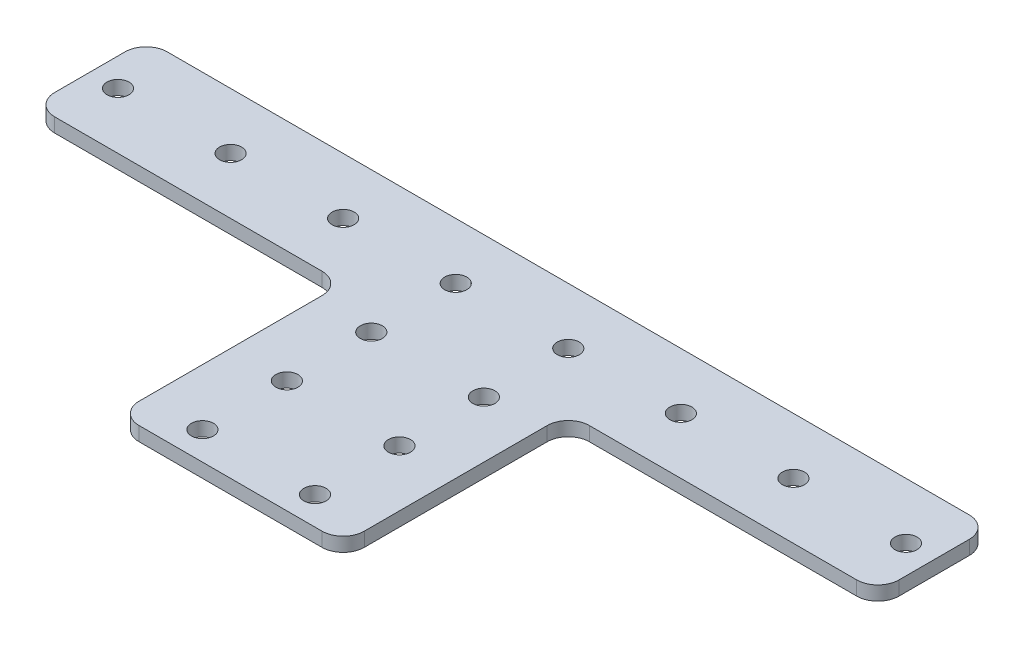
ISO-10303-21;
HEADER;
FILE_DESCRIPTION(('STEP AP214'),'2;1');
FILE_NAME('part.step','',(''),(''),'','','');
FILE_SCHEMA(('AUTOMOTIVE_DESIGN { 1 0 10303 214 1 1 1 1 }'));
ENDSEC;
DATA;
#1=APPLICATION_CONTEXT('core data for automotive mechanical design processes');
#2=APPLICATION_PROTOCOL_DEFINITION('international standard','automotive_design',2000,#1);
#3=PRODUCT_CONTEXT('',#1,'mechanical');
#4=PRODUCT('Part','Part','',(#3));
#5=PRODUCT_RELATED_PRODUCT_CATEGORY('part','',(#4));
#6=PRODUCT_DEFINITION_FORMATION('','',#4);
#7=PRODUCT_DEFINITION_CONTEXT('part definition',#1,'design');
#8=PRODUCT_DEFINITION('design','',#6,#7);
#9=PRODUCT_DEFINITION_SHAPE('','',#8);
#10=(LENGTH_UNIT() NAMED_UNIT(*) SI_UNIT(.MILLI.,.METRE.));
#11=(NAMED_UNIT(*) PLANE_ANGLE_UNIT() SI_UNIT($,.RADIAN.));
#12=(NAMED_UNIT(*) SI_UNIT($,.STERADIAN.) SOLID_ANGLE_UNIT());
#13=UNCERTAINTY_MEASURE_WITH_UNIT(LENGTH_MEASURE(1.E-05),#10,'distance_accuracy_value','');
#14=(GEOMETRIC_REPRESENTATION_CONTEXT(3) GLOBAL_UNCERTAINTY_ASSIGNED_CONTEXT((#13)) GLOBAL_UNIT_ASSIGNED_CONTEXT((#10,
#11,#12)) REPRESENTATION_CONTEXT('',''));
#15=CARTESIAN_POINT('',(0.,0.,0.));
#16=DIRECTION('',(0.,0.,1.));
#17=DIRECTION('',(1.,0.,0.));
#18=AXIS2_PLACEMENT_3D('',#15,#16,#17);
#19=CARTESIAN_POINT('',(120.65,3.175,0.));
#20=DIRECTION('',(1.,0.,0.));
#21=DIRECTION('',(0.,0.,-1.));
#22=AXIS2_PLACEMENT_3D('',#19,#20,#21);
#23=PLANE('',#22);
#24=DIRECTION('',(0.,0.,1.));
#25=VECTOR('',#24,1.);
#26=CARTESIAN_POINT('',(120.65,0.,0.));
#27=LINE('',#26,#25);
#28=CARTESIAN_POINT('',(120.65,0.,4.7625));
#29=VERTEX_POINT('',#28);
#30=CARTESIAN_POINT('',(120.65,0.,46.0375));
#31=VERTEX_POINT('',#30);
#32=EDGE_CURVE('E185',#29,#31,#27,.T.);
#33=ORIENTED_EDGE('',*,*,#32,.F.);
#34=DIRECTION('',(0.,-1.,0.));
#35=VECTOR('',#34,1.);
#36=CARTESIAN_POINT('',(120.65,3.175,4.7625));
#37=LINE('',#36,#35);
#38=CARTESIAN_POINT('',(120.65,3.175,4.7625));
#39=VERTEX_POINT('',#38);
#40=EDGE_CURVE('E259',#29,#39,#37,.F.);
#41=ORIENTED_EDGE('',*,*,#40,.T.);
#42=DIRECTION('',(0.,0.,1.));
#43=VECTOR('',#42,1.);
#44=CARTESIAN_POINT('',(120.65,3.175,0.));
#45=LINE('',#44,#43);
#46=CARTESIAN_POINT('',(120.65,3.175,46.0375));
#47=VERTEX_POINT('',#46);
#48=EDGE_CURVE('E362',#39,#47,#45,.T.);
#49=ORIENTED_EDGE('',*,*,#48,.T.);
#50=DIRECTION('',(0.,-1.,0.));
#51=VECTOR('',#50,1.);
#52=CARTESIAN_POINT('',(120.65,0.,46.0375));
#53=LINE('',#52,#51);
#54=EDGE_CURVE('E256',#47,#31,#53,.T.);
#55=ORIENTED_EDGE('',*,*,#54,.T.);
#56=EDGE_LOOP('',(#33,#41,#49,#55));
#57=FACE_BOUND('',#56,.T.);
#58=ADVANCED_FACE('F39',(#57),#23,.T.);
#59=CARTESIAN_POINT('',(0.,3.175,0.));
#60=DIRECTION('',(0.,0.,-1.));
#61=DIRECTION('',(-1.,0.,0.));
#62=AXIS2_PLACEMENT_3D('',#59,#60,#61);
#63=PLANE('',#62);
#64=DIRECTION('',(1.,0.,0.));
#65=VECTOR('',#64,1.);
#66=CARTESIAN_POINT('',(0.,0.,0.));
#67=LINE('',#66,#65);
#68=CARTESIAN_POINT('',(125.4125,0.,0.));
#69=VERTEX_POINT('',#68);
#70=CARTESIAN_POINT('',(185.7375,0.,0.));
#71=VERTEX_POINT('',#70);
#72=EDGE_CURVE('E181',#69,#71,#67,.T.);
#73=ORIENTED_EDGE('',*,*,#72,.T.);
#74=DIRECTION('',(0.,-1.,0.));
#75=VECTOR('',#74,1.);
#76=CARTESIAN_POINT('',(185.7375,3.175,0.));
#77=LINE('',#76,#75);
#78=CARTESIAN_POINT('',(185.7375,3.175,0.));
#79=VERTEX_POINT('',#78);
#80=EDGE_CURVE('E158',#71,#79,#77,.F.);
#81=ORIENTED_EDGE('',*,*,#80,.T.);
#82=DIRECTION('',(1.,0.,0.));
#83=VECTOR('',#82,1.);
#84=CARTESIAN_POINT('',(0.,3.175,0.));
#85=LINE('',#84,#83);
#86=CARTESIAN_POINT('',(125.4125,3.175,0.));
#87=VERTEX_POINT('',#86);
#88=EDGE_CURVE('E306',#87,#79,#85,.T.);
#89=ORIENTED_EDGE('',*,*,#88,.F.);
#90=DIRECTION('',(0.,-1.,0.));
#91=VECTOR('',#90,1.);
#92=CARTESIAN_POINT('',(125.4125,3.175,0.));
#93=LINE('',#92,#91);
#94=EDGE_CURVE('E163',#87,#69,#93,.T.);
#95=ORIENTED_EDGE('',*,*,#94,.T.);
#96=EDGE_LOOP('',(#73,#81,#89,#95));
#97=FACE_BOUND('',#96,.T.);
#98=ADVANCED_FACE('F364',(#97),#63,.F.);
#99=CARTESIAN_POINT('',(190.5,3.175,0.));
#100=DIRECTION('',(-1.,0.,0.));
#101=DIRECTION('',(0.,0.,1.));
#102=AXIS2_PLACEMENT_3D('',#99,#100,#101);
#103=PLANE('',#102);
#104=DIRECTION('',(0.,0.,-1.));
#105=VECTOR('',#104,1.);
#106=CARTESIAN_POINT('',(190.5,3.175,0.));
#107=LINE('',#106,#105);
#108=CARTESIAN_POINT('',(190.5,3.175,-4.7625));
#109=VERTEX_POINT('',#108);
#110=CARTESIAN_POINT('',(190.5,3.175,-20.6375));
#111=VERTEX_POINT('',#110);
#112=EDGE_CURVE('E173',#109,#111,#107,.T.);
#113=ORIENTED_EDGE('',*,*,#112,.F.);
#114=DIRECTION('',(0.,-1.,0.));
#115=VECTOR('',#114,1.);
#116=CARTESIAN_POINT('',(190.5,3.175,-4.7625));
#117=LINE('',#116,#115);
#118=CARTESIAN_POINT('',(190.5,0.,-4.7625));
#119=VERTEX_POINT('',#118);
#120=EDGE_CURVE('E157',#109,#119,#117,.T.);
#121=ORIENTED_EDGE('',*,*,#120,.T.);
#122=DIRECTION('',(0.,0.,-1.));
#123=VECTOR('',#122,1.);
#124=CARTESIAN_POINT('',(190.5,0.,0.));
#125=LINE('',#124,#123);
#126=CARTESIAN_POINT('',(190.5,0.,-20.6375));
#127=VERTEX_POINT('',#126);
#128=EDGE_CURVE('E170',#119,#127,#125,.T.);
#129=ORIENTED_EDGE('',*,*,#128,.T.);
#130=DIRECTION('',(0.,-1.,0.));
#131=VECTOR('',#130,1.);
#132=CARTESIAN_POINT('',(190.5,3.175,-20.6375));
#133=LINE('',#132,#131);
#134=EDGE_CURVE('E175',#127,#111,#133,.F.);
#135=ORIENTED_EDGE('',*,*,#134,.T.);
#136=EDGE_LOOP('',(#113,#121,#129,#135));
#137=FACE_BOUND('',#136,.T.);
#138=ADVANCED_FACE('F169',(#137),#103,.F.);
#139=CARTESIAN_POINT('',(0.,3.175,-25.4));
#140=DIRECTION('',(0.,0.,-1.));
#141=DIRECTION('',(-1.,0.,0.));
#142=AXIS2_PLACEMENT_3D('',#139,#140,#141);
#143=PLANE('',#142);
#144=DIRECTION('',(1.,0.,0.));
#145=VECTOR('',#144,1.);
#146=CARTESIAN_POINT('',(0.,0.,-25.4));
#147=LINE('',#146,#145);
#148=CARTESIAN_POINT('',(4.7625,0.,-25.4));
#149=VERTEX_POINT('',#148);
#150=CARTESIAN_POINT('',(185.7375,0.,-25.4));
#151=VERTEX_POINT('',#150);
#152=EDGE_CURVE('E180',#149,#151,#147,.T.);
#153=ORIENTED_EDGE('',*,*,#152,.F.);
#154=DIRECTION('',(0.,-1.,0.));
#155=VECTOR('',#154,1.);
#156=CARTESIAN_POINT('',(4.7625,3.175,-25.4));
#157=LINE('',#156,#155);
#158=CARTESIAN_POINT('',(4.7625,3.175,-25.4));
#159=VERTEX_POINT('',#158);
#160=EDGE_CURVE('E273',#149,#159,#157,.F.);
#161=ORIENTED_EDGE('',*,*,#160,.T.);
#162=DIRECTION('',(1.,0.,0.));
#163=VECTOR('',#162,1.);
#164=CARTESIAN_POINT('',(0.,3.175,-25.4));
#165=LINE('',#164,#163);
#166=CARTESIAN_POINT('',(185.7375,3.175,-25.4));
#167=VERTEX_POINT('',#166);
#168=EDGE_CURVE('E365',#159,#167,#165,.T.);
#169=ORIENTED_EDGE('',*,*,#168,.T.);
#170=DIRECTION('',(0.,-1.,0.));
#171=VECTOR('',#170,1.);
#172=CARTESIAN_POINT('',(185.7375,0.,-25.4));
#173=LINE('',#172,#171);
#174=EDGE_CURVE('E270',#167,#151,#173,.T.);
#175=ORIENTED_EDGE('',*,*,#174,.T.);
#176=EDGE_LOOP('',(#153,#161,#169,#175));
#177=FACE_BOUND('',#176,.T.);
#178=ADVANCED_FACE('F387',(#177),#143,.T.);
#179=CARTESIAN_POINT('',(0.,3.175,0.));
#180=DIRECTION('',(-1.,0.,0.));
#181=DIRECTION('',(0.,0.,1.));
#182=AXIS2_PLACEMENT_3D('',#179,#180,#181);
#183=PLANE('',#182);
#184=DIRECTION('',(0.,0.,-1.));
#185=VECTOR('',#184,1.);
#186=CARTESIAN_POINT('',(0.,0.,0.));
#187=LINE('',#186,#185);
#188=CARTESIAN_POINT('',(0.,0.,-4.7625));
#189=VERTEX_POINT('',#188);
#190=CARTESIAN_POINT('',(0.,0.,-20.6375));
#191=VERTEX_POINT('',#190);
#192=EDGE_CURVE('E183',#189,#191,#187,.T.);
#193=ORIENTED_EDGE('',*,*,#192,.F.);
#194=DIRECTION('',(0.,-1.,0.));
#195=VECTOR('',#194,1.);
#196=CARTESIAN_POINT('',(0.,3.175,-4.7625));
#197=LINE('',#196,#195);
#198=CARTESIAN_POINT('',(0.,3.175,-4.7625));
#199=VERTEX_POINT('',#198);
#200=EDGE_CURVE('E254',#189,#199,#197,.F.);
#201=ORIENTED_EDGE('',*,*,#200,.T.);
#202=DIRECTION('',(0.,0.,-1.));
#203=VECTOR('',#202,1.);
#204=CARTESIAN_POINT('',(0.,3.175,0.));
#205=LINE('',#204,#203);
#206=CARTESIAN_POINT('',(0.,3.175,-20.6375));
#207=VERTEX_POINT('',#206);
#208=EDGE_CURVE('E304',#199,#207,#205,.T.);
#209=ORIENTED_EDGE('',*,*,#208,.T.);
#210=DIRECTION('',(0.,-1.,0.));
#211=VECTOR('',#210,1.);
#212=CARTESIAN_POINT('',(0.,3.175,-20.6375));
#213=LINE('',#212,#211);
#214=EDGE_CURVE('E251',#207,#191,#213,.T.);
#215=ORIENTED_EDGE('',*,*,#214,.T.);
#216=EDGE_LOOP('',(#193,#201,#209,#215));
#217=FACE_BOUND('',#216,.T.);
#218=ADVANCED_FACE('F379',(#217),#183,.T.);
#219=CARTESIAN_POINT('',(4.7625,3.175,0.));
#220=VERTEX_POINT('',#219);
#221=CARTESIAN_POINT('',(65.0875,3.175,0.));
#222=VERTEX_POINT('',#221);
#223=EDGE_CURVE('E296',#220,#222,#85,.T.);
#224=ORIENTED_EDGE('',*,*,#223,.F.);
#225=DIRECTION('',(0.,-1.,0.));
#226=VECTOR('',#225,1.);
#227=CARTESIAN_POINT('',(4.7625,0.,0.));
#228=LINE('',#227,#226);
#229=CARTESIAN_POINT('',(4.7625,0.,0.));
#230=VERTEX_POINT('',#229);
#231=EDGE_CURVE('E248',#220,#230,#228,.T.);
#232=ORIENTED_EDGE('',*,*,#231,.T.);
#233=CARTESIAN_POINT('',(65.0875,0.,0.));
#234=VERTEX_POINT('',#233);
#235=EDGE_CURVE('E187',#230,#234,#67,.T.);
#236=ORIENTED_EDGE('',*,*,#235,.T.);
#237=DIRECTION('',(0.,-1.,0.));
#238=VECTOR('',#237,1.);
#239=CARTESIAN_POINT('',(65.0875,3.175,0.));
#240=LINE('',#239,#238);
#241=EDGE_CURVE('E246',#234,#222,#240,.F.);
#242=ORIENTED_EDGE('',*,*,#241,.T.);
#243=EDGE_LOOP('',(#224,#232,#236,#242));
#244=FACE_BOUND('',#243,.T.);
#245=ADVANCED_FACE('F286',(#244),#63,.F.);
#246=CARTESIAN_POINT('',(69.85,3.175,0.));
#247=DIRECTION('',(1.,0.,0.));
#248=DIRECTION('',(0.,0.,-1.));
#249=AXIS2_PLACEMENT_3D('',#246,#247,#248);
#250=PLANE('',#249);
#251=DIRECTION('',(0.,0.,1.));
#252=VECTOR('',#251,1.);
#253=CARTESIAN_POINT('',(69.85,3.175,0.));
#254=LINE('',#253,#252);
#255=CARTESIAN_POINT('',(69.85,3.175,4.7625));
#256=VERTEX_POINT('',#255);
#257=CARTESIAN_POINT('',(69.85,3.175,46.0375));
#258=VERTEX_POINT('',#257);
#259=EDGE_CURVE('E295',#256,#258,#254,.T.);
#260=ORIENTED_EDGE('',*,*,#259,.F.);
#261=DIRECTION('',(0.,-1.,0.));
#262=VECTOR('',#261,1.);
#263=CARTESIAN_POINT('',(69.85,0.,4.7625));
#264=LINE('',#263,#262);
#265=CARTESIAN_POINT('',(69.85,0.,4.7625));
#266=VERTEX_POINT('',#265);
#267=EDGE_CURVE('E263',#256,#266,#264,.T.);
#268=ORIENTED_EDGE('',*,*,#267,.T.);
#269=DIRECTION('',(0.,0.,1.));
#270=VECTOR('',#269,1.);
#271=CARTESIAN_POINT('',(69.85,0.,0.));
#272=LINE('',#271,#270);
#273=CARTESIAN_POINT('',(69.85,0.,46.0375));
#274=VERTEX_POINT('',#273);
#275=EDGE_CURVE('E192',#266,#274,#272,.T.);
#276=ORIENTED_EDGE('',*,*,#275,.T.);
#277=DIRECTION('',(0.,-1.,0.));
#278=VECTOR('',#277,1.);
#279=CARTESIAN_POINT('',(69.85,3.175,46.0375));
#280=LINE('',#279,#278);
#281=EDGE_CURVE('E261',#274,#258,#280,.F.);
#282=ORIENTED_EDGE('',*,*,#281,.T.);
#283=EDGE_LOOP('',(#260,#268,#276,#282));
#284=FACE_BOUND('',#283,.T.);
#285=ADVANCED_FACE('F298',(#284),#250,.F.);
#286=CARTESIAN_POINT('',(31.75,3.175,-12.7));
#287=DIRECTION('',(0.,-1.,0.));
#288=DIRECTION('',(0.,0.,-1.));
#289=AXIS2_PLACEMENT_3D('',#286,#287,#288);
#290=CYLINDRICAL_SURFACE('',#289,2.4892);
#291=CARTESIAN_POINT('',(31.75,3.175,-12.7));
#292=DIRECTION('',(0.,1.,0.));
#293=DIRECTION('',(0.,0.,1.));
#294=AXIS2_PLACEMENT_3D('',#291,#292,#293);
#295=CIRCLE('',#294,2.4892);
#296=CARTESIAN_POINT('',(31.75,3.175,-10.2108));
#297=VERTEX_POINT('',#296);
#298=EDGE_CURVE('E327',#297,#297,#295,.T.);
#299=ORIENTED_EDGE('',*,*,#298,.T.);
#300=EDGE_LOOP('',(#299));
#301=FACE_BOUND('',#300,.T.);
#302=CARTESIAN_POINT('',(31.75,0.,-12.7));
#303=DIRECTION('',(0.,1.,0.));
#304=DIRECTION('',(0.,0.,1.));
#305=AXIS2_PLACEMENT_3D('',#302,#303,#304);
#306=CIRCLE('',#305,2.4892);
#307=CARTESIAN_POINT('',(31.75,0.,-10.2108));
#308=VERTEX_POINT('',#307);
#309=EDGE_CURVE('E215',#308,#308,#306,.T.);
#310=ORIENTED_EDGE('',*,*,#309,.F.);
#311=EDGE_LOOP('',(#310));
#312=FACE_BOUND('',#311,.T.);
#313=ADVANCED_FACE('F462',(#301,#312),#290,.F.);
#314=CARTESIAN_POINT('',(57.15,3.175,-12.7));
#315=DIRECTION('',(0.,-1.,0.));
#316=DIRECTION('',(0.,0.,-1.));
#317=AXIS2_PLACEMENT_3D('',#314,#315,#316);
#318=CYLINDRICAL_SURFACE('',#317,2.4892);
#319=CARTESIAN_POINT('',(57.15,3.175,-12.7));
#320=DIRECTION('',(0.,1.,0.));
#321=DIRECTION('',(0.,0.,1.));
#322=AXIS2_PLACEMENT_3D('',#319,#320,#321);
#323=CIRCLE('',#322,2.4892);
#324=CARTESIAN_POINT('',(57.15,3.175,-10.2108));
#325=VERTEX_POINT('',#324);
#326=EDGE_CURVE('E324',#325,#325,#323,.T.);
#327=ORIENTED_EDGE('',*,*,#326,.T.);
#328=EDGE_LOOP('',(#327));
#329=FACE_BOUND('',#328,.T.);
#330=CARTESIAN_POINT('',(57.15,0.,-12.7));
#331=DIRECTION('',(0.,1.,0.));
#332=DIRECTION('',(0.,0.,1.));
#333=AXIS2_PLACEMENT_3D('',#330,#331,#332);
#334=CIRCLE('',#333,2.4892);
#335=CARTESIAN_POINT('',(57.15,0.,-10.2108));
#336=VERTEX_POINT('',#335);
#337=EDGE_CURVE('E212',#336,#336,#334,.T.);
#338=ORIENTED_EDGE('',*,*,#337,.F.);
#339=EDGE_LOOP('',(#338));
#340=FACE_BOUND('',#339,.T.);
#341=ADVANCED_FACE('F573',(#329,#340),#318,.F.);
#342=CARTESIAN_POINT('',(82.55,3.175,-12.7));
#343=DIRECTION('',(0.,-1.,0.));
#344=DIRECTION('',(0.,0.,-1.));
#345=AXIS2_PLACEMENT_3D('',#342,#343,#344);
#346=CYLINDRICAL_SURFACE('',#345,2.4892);
#347=CARTESIAN_POINT('',(82.55,3.175,-12.7));
#348=DIRECTION('',(0.,1.,0.));
#349=DIRECTION('',(0.,0.,1.));
#350=AXIS2_PLACEMENT_3D('',#347,#348,#349);
#351=CIRCLE('',#350,2.4892);
#352=CARTESIAN_POINT('',(82.55,3.175,-10.2108));
#353=VERTEX_POINT('',#352);
#354=EDGE_CURVE('E321',#353,#353,#351,.T.);
#355=ORIENTED_EDGE('',*,*,#354,.T.);
#356=EDGE_LOOP('',(#355));
#357=FACE_BOUND('',#356,.T.);
#358=CARTESIAN_POINT('',(82.55,0.,-12.7));
#359=DIRECTION('',(0.,1.,0.));
#360=DIRECTION('',(0.,0.,1.));
#361=AXIS2_PLACEMENT_3D('',#358,#359,#360);
#362=CIRCLE('',#361,2.4892);
#363=CARTESIAN_POINT('',(82.55,0.,-10.2108));
#364=VERTEX_POINT('',#363);
#365=EDGE_CURVE('E209',#364,#364,#362,.T.);
#366=ORIENTED_EDGE('',*,*,#365,.F.);
#367=EDGE_LOOP('',(#366));
#368=FACE_BOUND('',#367,.T.);
#369=ADVANCED_FACE('F563',(#357,#368),#346,.F.);
#370=CARTESIAN_POINT('',(107.95,3.175,-12.7));
#371=DIRECTION('',(0.,-1.,0.));
#372=DIRECTION('',(0.,0.,-1.));
#373=AXIS2_PLACEMENT_3D('',#370,#371,#372);
#374=CYLINDRICAL_SURFACE('',#373,2.4892);
#375=CARTESIAN_POINT('',(107.95,3.175,-12.7));
#376=DIRECTION('',(0.,1.,0.));
#377=DIRECTION('',(0.,0.,1.));
#378=AXIS2_PLACEMENT_3D('',#375,#376,#377);
#379=CIRCLE('',#378,2.4892);
#380=CARTESIAN_POINT('',(107.95,3.175,-10.2108));
#381=VERTEX_POINT('',#380);
#382=EDGE_CURVE('E318',#381,#381,#379,.T.);
#383=ORIENTED_EDGE('',*,*,#382,.T.);
#384=EDGE_LOOP('',(#383));
#385=FACE_BOUND('',#384,.T.);
#386=CARTESIAN_POINT('',(107.95,0.,-12.7));
#387=DIRECTION('',(0.,1.,0.));
#388=DIRECTION('',(0.,0.,1.));
#389=AXIS2_PLACEMENT_3D('',#386,#387,#388);
#390=CIRCLE('',#389,2.4892);
#391=CARTESIAN_POINT('',(107.95,0.,-10.2108));
#392=VERTEX_POINT('',#391);
#393=EDGE_CURVE('E206',#392,#392,#390,.T.);
#394=ORIENTED_EDGE('',*,*,#393,.F.);
#395=EDGE_LOOP('',(#394));
#396=FACE_BOUND('',#395,.T.);
#397=ADVANCED_FACE('F553',(#385,#396),#374,.F.);
#398=CARTESIAN_POINT('',(133.35,3.175,-12.7));
#399=DIRECTION('',(0.,-1.,0.));
#400=DIRECTION('',(0.,0.,-1.));
#401=AXIS2_PLACEMENT_3D('',#398,#399,#400);
#402=CYLINDRICAL_SURFACE('',#401,2.4892);
#403=CARTESIAN_POINT('',(133.35,3.175,-12.7));
#404=DIRECTION('',(0.,1.,0.));
#405=DIRECTION('',(0.,0.,1.));
#406=AXIS2_PLACEMENT_3D('',#403,#404,#405);
#407=CIRCLE('',#406,2.4892);
#408=CARTESIAN_POINT('',(133.35,3.175,-10.2108));
#409=VERTEX_POINT('',#408);
#410=EDGE_CURVE('E315',#409,#409,#407,.T.);
#411=ORIENTED_EDGE('',*,*,#410,.T.);
#412=EDGE_LOOP('',(#411));
#413=FACE_BOUND('',#412,.T.);
#414=CARTESIAN_POINT('',(133.35,0.,-12.7));
#415=DIRECTION('',(0.,1.,0.));
#416=DIRECTION('',(0.,0.,1.));
#417=AXIS2_PLACEMENT_3D('',#414,#415,#416);
#418=CIRCLE('',#417,2.4892);
#419=CARTESIAN_POINT('',(133.35,0.,-10.2108));
#420=VERTEX_POINT('',#419);
#421=EDGE_CURVE('E203',#420,#420,#418,.T.);
#422=ORIENTED_EDGE('',*,*,#421,.F.);
#423=EDGE_LOOP('',(#422));
#424=FACE_BOUND('',#423,.T.);
#425=ADVANCED_FACE('F544',(#413,#424),#402,.F.);
#426=CARTESIAN_POINT('',(158.75,3.175,-12.7));
#427=DIRECTION('',(0.,-1.,0.));
#428=DIRECTION('',(0.,0.,-1.));
#429=AXIS2_PLACEMENT_3D('',#426,#427,#428);
#430=CYLINDRICAL_SURFACE('',#429,2.4892);
#431=CARTESIAN_POINT('',(158.75,3.175,-12.7));
#432=DIRECTION('',(0.,1.,0.));
#433=DIRECTION('',(0.,0.,1.));
#434=AXIS2_PLACEMENT_3D('',#431,#432,#433);
#435=CIRCLE('',#434,2.4892);
#436=CARTESIAN_POINT('',(158.75,3.175,-10.2108));
#437=VERTEX_POINT('',#436);
#438=EDGE_CURVE('E312',#437,#437,#435,.T.);
#439=ORIENTED_EDGE('',*,*,#438,.T.);
#440=EDGE_LOOP('',(#439));
#441=FACE_BOUND('',#440,.T.);
#442=CARTESIAN_POINT('',(158.75,0.,-12.7));
#443=DIRECTION('',(0.,1.,0.));
#444=DIRECTION('',(0.,0.,1.));
#445=AXIS2_PLACEMENT_3D('',#442,#443,#444);
#446=CIRCLE('',#445,2.4892);
#447=CARTESIAN_POINT('',(158.75,0.,-10.2108));
#448=VERTEX_POINT('',#447);
#449=EDGE_CURVE('E200',#448,#448,#446,.T.);
#450=ORIENTED_EDGE('',*,*,#449,.F.);
#451=EDGE_LOOP('',(#450));
#452=FACE_BOUND('',#451,.T.);
#453=ADVANCED_FACE('F456',(#441,#452),#430,.F.);
#454=CARTESIAN_POINT('',(184.15,3.175,-12.7));
#455=DIRECTION('',(0.,-1.,0.));
#456=DIRECTION('',(0.,0.,-1.));
#457=AXIS2_PLACEMENT_3D('',#454,#455,#456);
#458=CYLINDRICAL_SURFACE('',#457,2.48920000000003);
#459=CARTESIAN_POINT('',(184.15,3.175,-12.7));
#460=DIRECTION('',(0.,1.,0.));
#461=DIRECTION('',(0.,0.,1.));
#462=AXIS2_PLACEMENT_3D('',#459,#460,#461);
#463=CIRCLE('',#462,2.48920000000003);
#464=CARTESIAN_POINT('',(184.15,3.175,-10.2108));
#465=VERTEX_POINT('',#464);
#466=EDGE_CURVE('E302',#465,#465,#463,.T.);
#467=ORIENTED_EDGE('',*,*,#466,.T.);
#468=EDGE_LOOP('',(#467));
#469=FACE_BOUND('',#468,.T.);
#470=CARTESIAN_POINT('',(184.15,0.,-12.7));
#471=DIRECTION('',(0.,1.,0.));
#472=DIRECTION('',(0.,0.,1.));
#473=AXIS2_PLACEMENT_3D('',#470,#471,#472);
#474=CIRCLE('',#473,2.48920000000003);
#475=CARTESIAN_POINT('',(184.15,0.,-10.2108));
#476=VERTEX_POINT('',#475);
#477=EDGE_CURVE('E197',#476,#476,#474,.T.);
#478=ORIENTED_EDGE('',*,*,#477,.F.);
#479=EDGE_LOOP('',(#478));
#480=FACE_BOUND('',#479,.T.);
#481=ADVANCED_FACE('F451',(#469,#480),#458,.F.);
#482=CARTESIAN_POINT('',(0.,3.175,50.8));
#483=DIRECTION('',(0.,0.,-1.));
#484=DIRECTION('',(-1.,0.,0.));
#485=AXIS2_PLACEMENT_3D('',#482,#483,#484);
#486=PLANE('',#485);
#487=DIRECTION('',(1.,0.,0.));
#488=VECTOR('',#487,1.);
#489=CARTESIAN_POINT('',(0.,0.,50.8));
#490=LINE('',#489,#488);
#491=CARTESIAN_POINT('',(74.6125,0.,50.8));
#492=VERTEX_POINT('',#491);
#493=CARTESIAN_POINT('',(115.8875,0.,50.8));
#494=VERTEX_POINT('',#493);
#495=EDGE_CURVE('E195',#492,#494,#490,.T.);
#496=ORIENTED_EDGE('',*,*,#495,.T.);
#497=DIRECTION('',(0.,-1.,0.));
#498=VECTOR('',#497,1.);
#499=CARTESIAN_POINT('',(115.8875,3.175,50.8));
#500=LINE('',#499,#498);
#501=CARTESIAN_POINT('',(115.8875,3.175,50.8));
#502=VERTEX_POINT('',#501);
#503=EDGE_CURVE('E54',#494,#502,#500,.F.);
#504=ORIENTED_EDGE('',*,*,#503,.T.);
#505=DIRECTION('',(1.,0.,0.));
#506=VECTOR('',#505,1.);
#507=CARTESIAN_POINT('',(0.,3.175,50.8));
#508=LINE('',#507,#506);
#509=CARTESIAN_POINT('',(74.6125,3.175,50.8));
#510=VERTEX_POINT('',#509);
#511=EDGE_CURVE('E300',#510,#502,#508,.T.);
#512=ORIENTED_EDGE('',*,*,#511,.F.);
#513=DIRECTION('',(0.,-1.,0.));
#514=VECTOR('',#513,1.);
#515=CARTESIAN_POINT('',(74.6125,3.175,50.8));
#516=LINE('',#515,#514);
#517=EDGE_CURVE('E266',#510,#492,#516,.T.);
#518=ORIENTED_EDGE('',*,*,#517,.T.);
#519=EDGE_LOOP('',(#496,#504,#512,#518));
#520=FACE_BOUND('',#519,.T.);
#521=ADVANCED_FACE('F408',(#520),#486,.F.);
#522=CARTESIAN_POINT('',(82.55,3.175,6.35));
#523=DIRECTION('',(0.,-1.,0.));
#524=DIRECTION('',(0.,0.,-1.));
#525=AXIS2_PLACEMENT_3D('',#522,#523,#524);
#526=CYLINDRICAL_SURFACE('',#525,2.4892);
#527=CARTESIAN_POINT('',(82.55,3.175,6.35));
#528=DIRECTION('',(0.,1.,0.));
#529=DIRECTION('',(0.,0.,1.));
#530=AXIS2_PLACEMENT_3D('',#527,#528,#529);
#531=CIRCLE('',#530,2.4892);
#532=CARTESIAN_POINT('',(82.55,3.175,8.8392));
#533=VERTEX_POINT('',#532);
#534=EDGE_CURVE('E367',#533,#533,#531,.T.);
#535=ORIENTED_EDGE('',*,*,#534,.T.);
#536=EDGE_LOOP('',(#535));
#537=FACE_BOUND('',#536,.T.);
#538=CARTESIAN_POINT('',(82.55,0.,6.35));
#539=DIRECTION('',(0.,1.,0.));
#540=DIRECTION('',(0.,0.,1.));
#541=AXIS2_PLACEMENT_3D('',#538,#539,#540);
#542=CIRCLE('',#541,2.4892);
#543=CARTESIAN_POINT('',(82.55,0.,8.8392));
#544=VERTEX_POINT('',#543);
#545=EDGE_CURVE('E347',#544,#544,#542,.T.);
#546=ORIENTED_EDGE('',*,*,#545,.F.);
#547=EDGE_LOOP('',(#546));
#548=FACE_BOUND('',#547,.T.);
#549=ADVANCED_FACE('F404',(#537,#548),#526,.F.);
#550=CARTESIAN_POINT('',(107.95,3.175,6.35));
#551=DIRECTION('',(0.,-1.,0.));
#552=DIRECTION('',(0.,0.,-1.));
#553=AXIS2_PLACEMENT_3D('',#550,#551,#552);
#554=CYLINDRICAL_SURFACE('',#553,2.4892);
#555=CARTESIAN_POINT('',(107.95,3.175,6.35));
#556=DIRECTION('',(0.,1.,0.));
#557=DIRECTION('',(0.,0.,1.));
#558=AXIS2_PLACEMENT_3D('',#555,#556,#557);
#559=CIRCLE('',#558,2.4892);
#560=CARTESIAN_POINT('',(107.95,3.175,8.8392));
#561=VERTEX_POINT('',#560);
#562=EDGE_CURVE('E739',#561,#561,#559,.T.);
#563=ORIENTED_EDGE('',*,*,#562,.T.);
#564=EDGE_LOOP('',(#563));
#565=FACE_BOUND('',#564,.T.);
#566=CARTESIAN_POINT('',(107.95,0.,6.35));
#567=DIRECTION('',(0.,1.,0.));
#568=DIRECTION('',(0.,0.,1.));
#569=AXIS2_PLACEMENT_3D('',#566,#567,#568);
#570=CIRCLE('',#569,2.4892);
#571=CARTESIAN_POINT('',(107.95,0.,8.8392));
#572=VERTEX_POINT('',#571);
#573=EDGE_CURVE('E344',#572,#572,#570,.T.);
#574=ORIENTED_EDGE('',*,*,#573,.F.);
#575=EDGE_LOOP('',(#574));
#576=FACE_BOUND('',#575,.T.);
#577=ADVANCED_FACE('F407',(#565,#576),#554,.F.);
#578=CARTESIAN_POINT('',(107.95,3.175,25.4));
#579=DIRECTION('',(0.,-1.,0.));
#580=DIRECTION('',(0.,0.,-1.));
#581=AXIS2_PLACEMENT_3D('',#578,#579,#580);
#582=CYLINDRICAL_SURFACE('',#581,2.4892);
#583=CARTESIAN_POINT('',(107.95,3.175,25.4));
#584=DIRECTION('',(0.,1.,0.));
#585=DIRECTION('',(0.,0.,1.));
#586=AXIS2_PLACEMENT_3D('',#583,#584,#585);
#587=CIRCLE('',#586,2.4892);
#588=CARTESIAN_POINT('',(107.95,3.175,27.8892));
#589=VERTEX_POINT('',#588);
#590=EDGE_CURVE('E735',#589,#589,#587,.T.);
#591=ORIENTED_EDGE('',*,*,#590,.T.);
#592=EDGE_LOOP('',(#591));
#593=FACE_BOUND('',#592,.T.);
#594=CARTESIAN_POINT('',(107.95,0.,25.4));
#595=DIRECTION('',(0.,1.,0.));
#596=DIRECTION('',(0.,0.,1.));
#597=AXIS2_PLACEMENT_3D('',#594,#595,#596);
#598=CIRCLE('',#597,2.4892);
#599=CARTESIAN_POINT('',(107.95,0.,27.8892));
#600=VERTEX_POINT('',#599);
#601=EDGE_CURVE('E341',#600,#600,#598,.T.);
#602=ORIENTED_EDGE('',*,*,#601,.F.);
#603=EDGE_LOOP('',(#602));
#604=FACE_BOUND('',#603,.T.);
#605=ADVANCED_FACE('F412',(#593,#604),#582,.F.);
#606=CARTESIAN_POINT('',(107.95,3.175,44.45));
#607=DIRECTION('',(0.,-1.,0.));
#608=DIRECTION('',(0.,0.,-1.));
#609=AXIS2_PLACEMENT_3D('',#606,#607,#608);
#610=CYLINDRICAL_SURFACE('',#609,2.4892);
#611=CARTESIAN_POINT('',(107.95,3.175,44.45));
#612=DIRECTION('',(0.,1.,0.));
#613=DIRECTION('',(0.,0.,1.));
#614=AXIS2_PLACEMENT_3D('',#611,#612,#613);
#615=CIRCLE('',#614,2.4892);
#616=CARTESIAN_POINT('',(107.95,3.175,46.9392));
#617=VERTEX_POINT('',#616);
#618=EDGE_CURVE('E731',#617,#617,#615,.T.);
#619=ORIENTED_EDGE('',*,*,#618,.T.);
#620=EDGE_LOOP('',(#619));
#621=FACE_BOUND('',#620,.T.);
#622=CARTESIAN_POINT('',(107.95,0.,44.45));
#623=DIRECTION('',(0.,1.,0.));
#624=DIRECTION('',(0.,0.,1.));
#625=AXIS2_PLACEMENT_3D('',#622,#623,#624);
#626=CIRCLE('',#625,2.4892);
#627=CARTESIAN_POINT('',(107.95,0.,46.9392));
#628=VERTEX_POINT('',#627);
#629=EDGE_CURVE('E338',#628,#628,#626,.T.);
#630=ORIENTED_EDGE('',*,*,#629,.F.);
#631=EDGE_LOOP('',(#630));
#632=FACE_BOUND('',#631,.T.);
#633=ADVANCED_FACE('F416',(#621,#632),#610,.F.);
#634=CARTESIAN_POINT('',(82.55,3.175,25.4));
#635=DIRECTION('',(0.,-1.,0.));
#636=DIRECTION('',(0.,0.,-1.));
#637=AXIS2_PLACEMENT_3D('',#634,#635,#636);
#638=CYLINDRICAL_SURFACE('',#637,2.4892);
#639=CARTESIAN_POINT('',(82.55,3.175,25.4));
#640=DIRECTION('',(0.,1.,0.));
#641=DIRECTION('',(0.,0.,1.));
#642=AXIS2_PLACEMENT_3D('',#639,#640,#641);
#643=CIRCLE('',#642,2.4892);
#644=CARTESIAN_POINT('',(82.55,3.175,27.8892));
#645=VERTEX_POINT('',#644);
#646=EDGE_CURVE('E727',#645,#645,#643,.T.);
#647=ORIENTED_EDGE('',*,*,#646,.T.);
#648=EDGE_LOOP('',(#647));
#649=FACE_BOUND('',#648,.T.);
#650=CARTESIAN_POINT('',(82.55,0.,25.4));
#651=DIRECTION('',(0.,1.,0.));
#652=DIRECTION('',(0.,0.,1.));
#653=AXIS2_PLACEMENT_3D('',#650,#651,#652);
#654=CIRCLE('',#653,2.4892);
#655=CARTESIAN_POINT('',(82.55,0.,27.8892));
#656=VERTEX_POINT('',#655);
#657=EDGE_CURVE('E335',#656,#656,#654,.T.);
#658=ORIENTED_EDGE('',*,*,#657,.F.);
#659=EDGE_LOOP('',(#658));
#660=FACE_BOUND('',#659,.T.);
#661=ADVANCED_FACE('F420',(#649,#660),#638,.F.);
#662=CARTESIAN_POINT('',(82.55,3.175,44.45));
#663=DIRECTION('',(0.,-1.,0.));
#664=DIRECTION('',(0.,0.,-1.));
#665=AXIS2_PLACEMENT_3D('',#662,#663,#664);
#666=CYLINDRICAL_SURFACE('',#665,2.48920000000002);
#667=CARTESIAN_POINT('',(82.55,3.175,44.45));
#668=DIRECTION('',(0.,1.,0.));
#669=DIRECTION('',(0.,0.,1.));
#670=AXIS2_PLACEMENT_3D('',#667,#668,#669);
#671=CIRCLE('',#670,2.48920000000002);
#672=CARTESIAN_POINT('',(82.55,3.175,46.9392));
#673=VERTEX_POINT('',#672);
#674=EDGE_CURVE('E221',#673,#673,#671,.T.);
#675=ORIENTED_EDGE('',*,*,#674,.T.);
#676=EDGE_LOOP('',(#675));
#677=FACE_BOUND('',#676,.T.);
#678=CARTESIAN_POINT('',(82.55,0.,44.45));
#679=DIRECTION('',(0.,1.,0.));
#680=DIRECTION('',(0.,0.,1.));
#681=AXIS2_PLACEMENT_3D('',#678,#679,#680);
#682=CIRCLE('',#681,2.48920000000002);
#683=CARTESIAN_POINT('',(82.55,0.,46.9392));
#684=VERTEX_POINT('',#683);
#685=EDGE_CURVE('E332',#684,#684,#682,.T.);
#686=ORIENTED_EDGE('',*,*,#685,.F.);
#687=EDGE_LOOP('',(#686));
#688=FACE_BOUND('',#687,.T.);
#689=ADVANCED_FACE('F424',(#677,#688),#666,.F.);
#690=CARTESIAN_POINT('',(6.35,3.175,-12.7));
#691=DIRECTION('',(0.,-1.,0.));
#692=DIRECTION('',(0.,0.,-1.));
#693=AXIS2_PLACEMENT_3D('',#690,#691,#692);
#694=CYLINDRICAL_SURFACE('',#693,2.4892);
#695=CARTESIAN_POINT('',(6.35,3.175,-12.7));
#696=DIRECTION('',(0.,1.,0.));
#697=DIRECTION('',(0.,0.,1.));
#698=AXIS2_PLACEMENT_3D('',#695,#696,#697);
#699=CIRCLE('',#698,2.4892);
#700=CARTESIAN_POINT('',(6.35,3.175,-10.2108));
#701=VERTEX_POINT('',#700);
#702=EDGE_CURVE('E222',#701,#701,#699,.T.);
#703=ORIENTED_EDGE('',*,*,#702,.T.);
#704=EDGE_LOOP('',(#703));
#705=FACE_BOUND('',#704,.T.);
#706=CARTESIAN_POINT('',(6.35,0.,-12.7));
#707=DIRECTION('',(0.,1.,0.));
#708=DIRECTION('',(0.,0.,1.));
#709=AXIS2_PLACEMENT_3D('',#706,#707,#708);
#710=CIRCLE('',#709,2.4892);
#711=CARTESIAN_POINT('',(6.35,0.,-10.2108));
#712=VERTEX_POINT('',#711);
#713=EDGE_CURVE('E218',#712,#712,#710,.T.);
#714=ORIENTED_EDGE('',*,*,#713,.F.);
#715=EDGE_LOOP('',(#714));
#716=FACE_BOUND('',#715,.T.);
#717=ADVANCED_FACE('F428',(#705,#716),#694,.F.);
#718=CARTESIAN_POINT('',(0.,3.175,0.));
#719=DIRECTION('',(0.,1.,0.));
#720=DIRECTION('',(0.,0.,1.));
#721=AXIS2_PLACEMENT_3D('',#718,#719,#720);
#722=PLANE('',#721);
#723=ORIENTED_EDGE('',*,*,#674,.F.);
#724=EDGE_LOOP('',(#723));
#725=FACE_BOUND('',#724,.T.);
#726=ORIENTED_EDGE('',*,*,#646,.F.);
#727=EDGE_LOOP('',(#726));
#728=FACE_BOUND('',#727,.T.);
#729=ORIENTED_EDGE('',*,*,#618,.F.);
#730=EDGE_LOOP('',(#729));
#731=FACE_BOUND('',#730,.T.);
#732=ORIENTED_EDGE('',*,*,#590,.F.);
#733=EDGE_LOOP('',(#732));
#734=FACE_BOUND('',#733,.T.);
#735=ORIENTED_EDGE('',*,*,#562,.F.);
#736=EDGE_LOOP('',(#735));
#737=FACE_BOUND('',#736,.T.);
#738=ORIENTED_EDGE('',*,*,#534,.F.);
#739=EDGE_LOOP('',(#738));
#740=FACE_BOUND('',#739,.T.);
#741=ORIENTED_EDGE('',*,*,#88,.T.);
#742=CARTESIAN_POINT('',(185.7375,3.175,-4.7625));
#743=DIRECTION('',(0.,1.,0.));
#744=DIRECTION('',(0.,0.,1.));
#745=AXIS2_PLACEMENT_3D('',#742,#743,#744);
#746=CIRCLE('',#745,4.7625);
#747=EDGE_CURVE('E244',#79,#109,#746,.T.);
#748=ORIENTED_EDGE('',*,*,#747,.T.);
#749=ORIENTED_EDGE('',*,*,#112,.T.);
#750=CARTESIAN_POINT('',(185.7375,3.175,-20.6375));
#751=DIRECTION('',(0.,1.,0.));
#752=DIRECTION('',(0.,0.,1.));
#753=AXIS2_PLACEMENT_3D('',#750,#751,#752);
#754=CIRCLE('',#753,4.7625);
#755=EDGE_CURVE('E235',#111,#167,#754,.T.);
#756=ORIENTED_EDGE('',*,*,#755,.T.);
#757=ORIENTED_EDGE('',*,*,#168,.F.);
#758=CARTESIAN_POINT('',(4.7625,3.175,-20.6375));
#759=DIRECTION('',(0.,1.,0.));
#760=DIRECTION('',(0.,0.,1.));
#761=AXIS2_PLACEMENT_3D('',#758,#759,#760);
#762=CIRCLE('',#761,4.7625);
#763=EDGE_CURVE('E237',#159,#207,#762,.T.);
#764=ORIENTED_EDGE('',*,*,#763,.T.);
#765=ORIENTED_EDGE('',*,*,#208,.F.);
#766=CARTESIAN_POINT('',(4.7625,3.175,-4.7625));
#767=DIRECTION('',(0.,1.,0.));
#768=DIRECTION('',(0.,0.,1.));
#769=AXIS2_PLACEMENT_3D('',#766,#767,#768);
#770=CIRCLE('',#769,4.7625);
#771=EDGE_CURVE('E242',#199,#220,#770,.T.);
#772=ORIENTED_EDGE('',*,*,#771,.T.);
#773=ORIENTED_EDGE('',*,*,#223,.T.);
#774=CARTESIAN_POINT('',(65.0875,3.175,4.7625));
#775=DIRECTION('',(0.,1.,0.));
#776=DIRECTION('',(0.,0.,1.));
#777=AXIS2_PLACEMENT_3D('',#774,#775,#776);
#778=CIRCLE('',#777,4.7625);
#779=EDGE_CURVE('E11',#222,#256,#778,.F.);
#780=ORIENTED_EDGE('',*,*,#779,.T.);
#781=ORIENTED_EDGE('',*,*,#259,.T.);
#782=CARTESIAN_POINT('',(74.6125,3.175,46.0375));
#783=DIRECTION('',(0.,1.,0.));
#784=DIRECTION('',(0.,0.,1.));
#785=AXIS2_PLACEMENT_3D('',#782,#783,#784);
#786=CIRCLE('',#785,4.7625);
#787=EDGE_CURVE('E61',#258,#510,#786,.T.);
#788=ORIENTED_EDGE('',*,*,#787,.T.);
#789=ORIENTED_EDGE('',*,*,#511,.T.);
#790=CARTESIAN_POINT('',(115.8875,3.175,46.0375));
#791=DIRECTION('',(0.,1.,0.));
#792=DIRECTION('',(0.,0.,1.));
#793=AXIS2_PLACEMENT_3D('',#790,#791,#792);
#794=CIRCLE('',#793,4.7625);
#795=EDGE_CURVE('E240',#502,#47,#794,.T.);
#796=ORIENTED_EDGE('',*,*,#795,.T.);
#797=ORIENTED_EDGE('',*,*,#48,.F.);
#798=CARTESIAN_POINT('',(125.4125,3.175,4.7625));
#799=DIRECTION('',(0.,1.,0.));
#800=DIRECTION('',(0.,0.,1.));
#801=AXIS2_PLACEMENT_3D('',#798,#799,#800);
#802=CIRCLE('',#801,4.7625);
#803=EDGE_CURVE('E277',#39,#87,#802,.F.);
#804=ORIENTED_EDGE('',*,*,#803,.T.);
#805=EDGE_LOOP('',(#741,#748,#749,#756,#757,#764,#765,#772,#773,#780,#781,#788,#789,#796,#797,#804));
#806=FACE_BOUND('',#805,.T.);
#807=ORIENTED_EDGE('',*,*,#466,.F.);
#808=EDGE_LOOP('',(#807));
#809=FACE_BOUND('',#808,.T.);
#810=ORIENTED_EDGE('',*,*,#438,.F.);
#811=EDGE_LOOP('',(#810));
#812=FACE_BOUND('',#811,.T.);
#813=ORIENTED_EDGE('',*,*,#410,.F.);
#814=EDGE_LOOP('',(#813));
#815=FACE_BOUND('',#814,.T.);
#816=ORIENTED_EDGE('',*,*,#382,.F.);
#817=EDGE_LOOP('',(#816));
#818=FACE_BOUND('',#817,.T.);
#819=ORIENTED_EDGE('',*,*,#354,.F.);
#820=EDGE_LOOP('',(#819));
#821=FACE_BOUND('',#820,.T.);
#822=ORIENTED_EDGE('',*,*,#326,.F.);
#823=EDGE_LOOP('',(#822));
#824=FACE_BOUND('',#823,.T.);
#825=ORIENTED_EDGE('',*,*,#298,.F.);
#826=EDGE_LOOP('',(#825));
#827=FACE_BOUND('',#826,.T.);
#828=ORIENTED_EDGE('',*,*,#702,.F.);
#829=EDGE_LOOP('',(#828));
#830=FACE_BOUND('',#829,.T.);
#831=ADVANCED_FACE('F293',(#725,#728,#731,#734,#737,#740,#806,#809,#812,#815,#818,#821,#824,
#827,#830),#722,.T.);
#832=CARTESIAN_POINT('',(0.,0.,0.));
#833=DIRECTION('',(0.,1.,0.));
#834=DIRECTION('',(0.,0.,1.));
#835=AXIS2_PLACEMENT_3D('',#832,#833,#834);
#836=PLANE('',#835);
#837=ORIENTED_EDGE('',*,*,#685,.T.);
#838=EDGE_LOOP('',(#837));
#839=FACE_BOUND('',#838,.T.);
#840=ORIENTED_EDGE('',*,*,#657,.T.);
#841=EDGE_LOOP('',(#840));
#842=FACE_BOUND('',#841,.T.);
#843=ORIENTED_EDGE('',*,*,#629,.T.);
#844=EDGE_LOOP('',(#843));
#845=FACE_BOUND('',#844,.T.);
#846=ORIENTED_EDGE('',*,*,#601,.T.);
#847=EDGE_LOOP('',(#846));
#848=FACE_BOUND('',#847,.T.);
#849=ORIENTED_EDGE('',*,*,#573,.T.);
#850=EDGE_LOOP('',(#849));
#851=FACE_BOUND('',#850,.T.);
#852=ORIENTED_EDGE('',*,*,#545,.T.);
#853=EDGE_LOOP('',(#852));
#854=FACE_BOUND('',#853,.T.);
#855=ORIENTED_EDGE('',*,*,#128,.F.);
#856=CARTESIAN_POINT('',(185.7375,0.,-4.7625));
#857=DIRECTION('',(0.,1.,0.));
#858=DIRECTION('',(0.,0.,1.));
#859=AXIS2_PLACEMENT_3D('',#856,#857,#858);
#860=CIRCLE('',#859,4.7625);
#861=EDGE_CURVE('E153',#119,#71,#860,.F.);
#862=ORIENTED_EDGE('',*,*,#861,.T.);
#863=ORIENTED_EDGE('',*,*,#72,.F.);
#864=CARTESIAN_POINT('',(125.4125,0.,4.7625));
#865=DIRECTION('',(0.,1.,0.));
#866=DIRECTION('',(0.,0.,1.));
#867=AXIS2_PLACEMENT_3D('',#864,#865,#866);
#868=CIRCLE('',#867,4.7625);
#869=EDGE_CURVE('E275',#69,#29,#868,.T.);
#870=ORIENTED_EDGE('',*,*,#869,.T.);
#871=ORIENTED_EDGE('',*,*,#32,.T.);
#872=CARTESIAN_POINT('',(115.8875,0.,46.0375));
#873=DIRECTION('',(0.,1.,0.));
#874=DIRECTION('',(0.,0.,1.));
#875=AXIS2_PLACEMENT_3D('',#872,#873,#874);
#876=CIRCLE('',#875,4.7625);
#877=EDGE_CURVE('E229',#31,#494,#876,.F.);
#878=ORIENTED_EDGE('',*,*,#877,.T.);
#879=ORIENTED_EDGE('',*,*,#495,.F.);
#880=CARTESIAN_POINT('',(74.6125,0.,46.0375));
#881=DIRECTION('',(0.,1.,0.));
#882=DIRECTION('',(0.,0.,1.));
#883=AXIS2_PLACEMENT_3D('',#880,#881,#882);
#884=CIRCLE('',#883,4.7625);
#885=EDGE_CURVE('E227',#492,#274,#884,.F.);
#886=ORIENTED_EDGE('',*,*,#885,.T.);
#887=ORIENTED_EDGE('',*,*,#275,.F.);
#888=CARTESIAN_POINT('',(65.0875,0.,4.7625));
#889=DIRECTION('',(0.,1.,0.));
#890=DIRECTION('',(0.,0.,1.));
#891=AXIS2_PLACEMENT_3D('',#888,#889,#890);
#892=CIRCLE('',#891,4.7625);
#893=EDGE_CURVE('E47',#266,#234,#892,.T.);
#894=ORIENTED_EDGE('',*,*,#893,.T.);
#895=ORIENTED_EDGE('',*,*,#235,.F.);
#896=CARTESIAN_POINT('',(4.7625,0.,-4.7625));
#897=DIRECTION('',(0.,1.,0.));
#898=DIRECTION('',(0.,0.,1.));
#899=AXIS2_PLACEMENT_3D('',#896,#897,#898);
#900=CIRCLE('',#899,4.7625);
#901=EDGE_CURVE('E164',#230,#189,#900,.F.);
#902=ORIENTED_EDGE('',*,*,#901,.T.);
#903=ORIENTED_EDGE('',*,*,#192,.T.);
#904=CARTESIAN_POINT('',(4.7625,0.,-20.6375));
#905=DIRECTION('',(0.,1.,0.));
#906=DIRECTION('',(0.,0.,1.));
#907=AXIS2_PLACEMENT_3D('',#904,#905,#906);
#908=CIRCLE('',#907,4.7625);
#909=EDGE_CURVE('E225',#191,#149,#908,.F.);
#910=ORIENTED_EDGE('',*,*,#909,.T.);
#911=ORIENTED_EDGE('',*,*,#152,.T.);
#912=CARTESIAN_POINT('',(185.7375,0.,-20.6375));
#913=DIRECTION('',(0.,1.,0.));
#914=DIRECTION('',(0.,0.,1.));
#915=AXIS2_PLACEMENT_3D('',#912,#913,#914);
#916=CIRCLE('',#915,4.7625);
#917=EDGE_CURVE('E174',#151,#127,#916,.F.);
#918=ORIENTED_EDGE('',*,*,#917,.T.);
#919=EDGE_LOOP('',(#855,#862,#863,#870,#871,#878,#879,#886,#887,#894,#895,#902,#903,#910,#911,#918));
#920=FACE_BOUND('',#919,.T.);
#921=ORIENTED_EDGE('',*,*,#477,.T.);
#922=EDGE_LOOP('',(#921));
#923=FACE_BOUND('',#922,.T.);
#924=ORIENTED_EDGE('',*,*,#449,.T.);
#925=EDGE_LOOP('',(#924));
#926=FACE_BOUND('',#925,.T.);
#927=ORIENTED_EDGE('',*,*,#421,.T.);
#928=EDGE_LOOP('',(#927));
#929=FACE_BOUND('',#928,.T.);
#930=ORIENTED_EDGE('',*,*,#393,.T.);
#931=EDGE_LOOP('',(#930));
#932=FACE_BOUND('',#931,.T.);
#933=ORIENTED_EDGE('',*,*,#365,.T.);
#934=EDGE_LOOP('',(#933));
#935=FACE_BOUND('',#934,.T.);
#936=ORIENTED_EDGE('',*,*,#337,.T.);
#937=EDGE_LOOP('',(#936));
#938=FACE_BOUND('',#937,.T.);
#939=ORIENTED_EDGE('',*,*,#309,.T.);
#940=EDGE_LOOP('',(#939));
#941=FACE_BOUND('',#940,.T.);
#942=ORIENTED_EDGE('',*,*,#713,.T.);
#943=EDGE_LOOP('',(#942));
#944=FACE_BOUND('',#943,.T.);
#945=ADVANCED_FACE('F177',(#839,#842,#845,#848,#851,#854,#920,#923,#926,#929,#932,#935,#938,
#941,#944),#836,.F.);
#946=CARTESIAN_POINT('',(185.7375,3.175,-4.7625));
#947=DIRECTION('',(0.,-1.,0.));
#948=DIRECTION('',(0.,0.,-1.));
#949=AXIS2_PLACEMENT_3D('',#946,#947,#948);
#950=CYLINDRICAL_SURFACE('',#949,4.7625);
#951=ORIENTED_EDGE('',*,*,#747,.F.);
#952=ORIENTED_EDGE('',*,*,#80,.F.);
#953=ORIENTED_EDGE('',*,*,#861,.F.);
#954=ORIENTED_EDGE('',*,*,#120,.F.);
#955=EDGE_LOOP('',(#951,#952,#953,#954));
#956=FACE_BOUND('',#955,.T.);
#957=ADVANCED_FACE('F156',(#956),#950,.T.);
#958=CARTESIAN_POINT('',(4.7625,3.175,-4.7625));
#959=DIRECTION('',(0.,1.,0.));
#960=DIRECTION('',(0.,0.,1.));
#961=AXIS2_PLACEMENT_3D('',#958,#959,#960);
#962=CYLINDRICAL_SURFACE('',#961,4.7625);
#963=ORIENTED_EDGE('',*,*,#771,.F.);
#964=ORIENTED_EDGE('',*,*,#200,.F.);
#965=ORIENTED_EDGE('',*,*,#901,.F.);
#966=ORIENTED_EDGE('',*,*,#231,.F.);
#967=EDGE_LOOP('',(#963,#964,#965,#966));
#968=FACE_BOUND('',#967,.T.);
#969=ADVANCED_FACE('F432',(#968),#962,.T.);
#970=CARTESIAN_POINT('',(125.4125,3.175,4.7625));
#971=DIRECTION('',(0.,-1.,0.));
#972=DIRECTION('',(0.,0.,-1.));
#973=AXIS2_PLACEMENT_3D('',#970,#971,#972);
#974=CYLINDRICAL_SURFACE('',#973,4.7625);
#975=ORIENTED_EDGE('',*,*,#803,.F.);
#976=ORIENTED_EDGE('',*,*,#40,.F.);
#977=ORIENTED_EDGE('',*,*,#869,.F.);
#978=ORIENTED_EDGE('',*,*,#94,.F.);
#979=EDGE_LOOP('',(#975,#976,#977,#978));
#980=FACE_BOUND('',#979,.T.);
#981=ADVANCED_FACE('F359',(#980),#974,.F.);
#982=CARTESIAN_POINT('',(65.0875,3.175,4.7625));
#983=DIRECTION('',(0.,1.,0.));
#984=DIRECTION('',(0.,0.,1.));
#985=AXIS2_PLACEMENT_3D('',#982,#983,#984);
#986=CYLINDRICAL_SURFACE('',#985,4.7625);
#987=ORIENTED_EDGE('',*,*,#779,.F.);
#988=ORIENTED_EDGE('',*,*,#241,.F.);
#989=ORIENTED_EDGE('',*,*,#893,.F.);
#990=ORIENTED_EDGE('',*,*,#267,.F.);
#991=EDGE_LOOP('',(#987,#988,#989,#990));
#992=FACE_BOUND('',#991,.T.);
#993=ADVANCED_FACE('F290',(#992),#986,.F.);
#994=CARTESIAN_POINT('',(115.8875,3.175,46.0375));
#995=DIRECTION('',(0.,1.,0.));
#996=DIRECTION('',(0.,0.,1.));
#997=AXIS2_PLACEMENT_3D('',#994,#995,#996);
#998=CYLINDRICAL_SURFACE('',#997,4.7625);
#999=ORIENTED_EDGE('',*,*,#795,.F.);
#1000=ORIENTED_EDGE('',*,*,#503,.F.);
#1001=ORIENTED_EDGE('',*,*,#877,.F.);
#1002=ORIENTED_EDGE('',*,*,#54,.F.);
#1003=EDGE_LOOP('',(#999,#1000,#1001,#1002));
#1004=FACE_BOUND('',#1003,.T.);
#1005=ADVANCED_FACE('F440',(#1004),#998,.T.);
#1006=CARTESIAN_POINT('',(74.6125,3.175,46.0375));
#1007=DIRECTION('',(0.,-1.,0.));
#1008=DIRECTION('',(0.,0.,-1.));
#1009=AXIS2_PLACEMENT_3D('',#1006,#1007,#1008);
#1010=CYLINDRICAL_SURFACE('',#1009,4.7625);
#1011=ORIENTED_EDGE('',*,*,#787,.F.);
#1012=ORIENTED_EDGE('',*,*,#281,.F.);
#1013=ORIENTED_EDGE('',*,*,#885,.F.);
#1014=ORIENTED_EDGE('',*,*,#517,.F.);
#1015=EDGE_LOOP('',(#1011,#1012,#1013,#1014));
#1016=FACE_BOUND('',#1015,.T.);
#1017=ADVANCED_FACE('F394',(#1016),#1010,.T.);
#1018=CARTESIAN_POINT('',(4.7625,3.175,-20.6375));
#1019=DIRECTION('',(0.,-1.,0.));
#1020=DIRECTION('',(0.,0.,-1.));
#1021=AXIS2_PLACEMENT_3D('',#1018,#1019,#1020);
#1022=CYLINDRICAL_SURFACE('',#1021,4.7625);
#1023=ORIENTED_EDGE('',*,*,#763,.F.);
#1024=ORIENTED_EDGE('',*,*,#160,.F.);
#1025=ORIENTED_EDGE('',*,*,#909,.F.);
#1026=ORIENTED_EDGE('',*,*,#214,.F.);
#1027=EDGE_LOOP('',(#1023,#1024,#1025,#1026));
#1028=FACE_BOUND('',#1027,.T.);
#1029=ADVANCED_FACE('F384',(#1028),#1022,.T.);
#1030=CARTESIAN_POINT('',(185.7375,3.175,-20.6375));
#1031=DIRECTION('',(0.,1.,0.));
#1032=DIRECTION('',(0.,0.,1.));
#1033=AXIS2_PLACEMENT_3D('',#1030,#1031,#1032);
#1034=CYLINDRICAL_SURFACE('',#1033,4.7625);
#1035=ORIENTED_EDGE('',*,*,#755,.F.);
#1036=ORIENTED_EDGE('',*,*,#134,.F.);
#1037=ORIENTED_EDGE('',*,*,#917,.F.);
#1038=ORIENTED_EDGE('',*,*,#174,.F.);
#1039=EDGE_LOOP('',(#1035,#1036,#1037,#1038));
#1040=FACE_BOUND('',#1039,.T.);
#1041=ADVANCED_FACE('F41',(#1040),#1034,.T.);
#1042=CLOSED_SHELL('',(#58,#98,#138,#178,#218,#245,#285,#313,#341,#369,#397,#425,#453,#481,#521,
#549,#577,#605,#633,#661,#689,#717,#831,#945,#957,#969,#981,#993,#1005,#1017,#1029,#1041));
#1043=MANIFOLD_SOLID_BREP('B2',#1042);
#1044=ADVANCED_BREP_SHAPE_REPRESENTATION('',(#18,#1043),#14);
#1045=SHAPE_DEFINITION_REPRESENTATION(#9,#1044);
ENDSEC;
END-ISO-10303-21;
